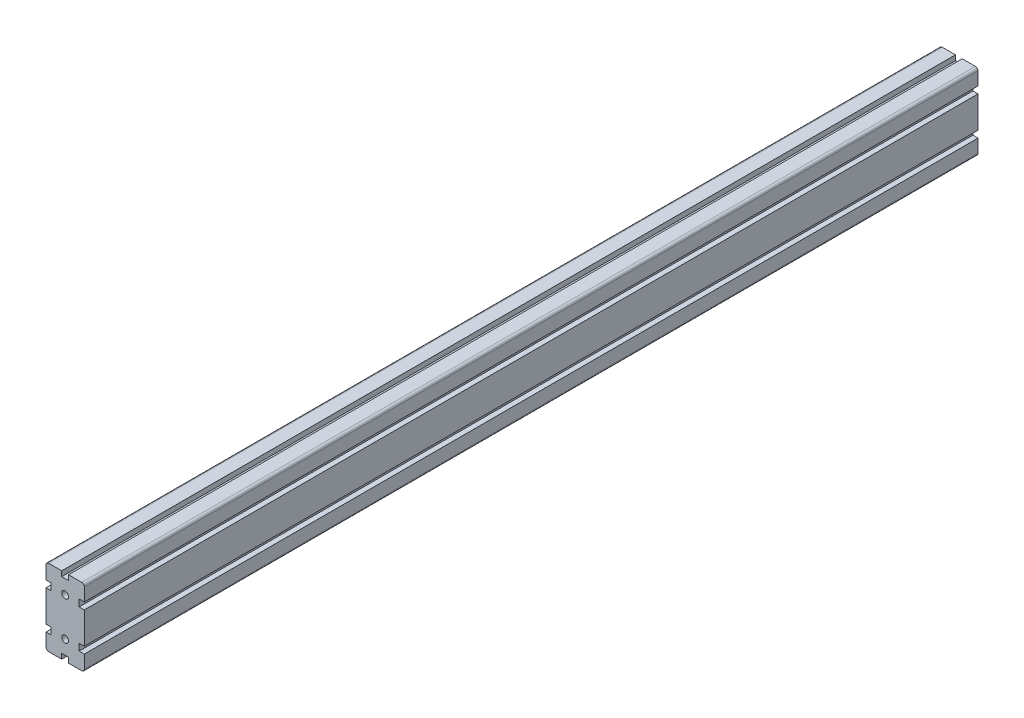
ISO-10303-21;
HEADER;
FILE_DESCRIPTION(('STEP AP214'),'2;1');
FILE_NAME('part.step','',(''),(''),'','','');
FILE_SCHEMA(('AUTOMOTIVE_DESIGN { 1 0 10303 214 1 1 1 1 }'));
ENDSEC;
DATA;
#1=APPLICATION_CONTEXT('core data for automotive mechanical design processes');
#2=APPLICATION_PROTOCOL_DEFINITION('international standard','automotive_design',2000,#1);
#3=PRODUCT_CONTEXT('',#1,'mechanical');
#4=PRODUCT('Part','Part','',(#3));
#5=PRODUCT_RELATED_PRODUCT_CATEGORY('part','',(#4));
#6=PRODUCT_DEFINITION_FORMATION('','',#4);
#7=PRODUCT_DEFINITION_CONTEXT('part definition',#1,'design');
#8=PRODUCT_DEFINITION('design','',#6,#7);
#9=PRODUCT_DEFINITION_SHAPE('','',#8);
#10=(LENGTH_UNIT() NAMED_UNIT(*) SI_UNIT(.MILLI.,.METRE.));
#11=(NAMED_UNIT(*) PLANE_ANGLE_UNIT() SI_UNIT($,.RADIAN.));
#12=(NAMED_UNIT(*) SI_UNIT($,.STERADIAN.) SOLID_ANGLE_UNIT());
#13=UNCERTAINTY_MEASURE_WITH_UNIT(LENGTH_MEASURE(1.E-05),#10,'distance_accuracy_value','');
#14=(GEOMETRIC_REPRESENTATION_CONTEXT(3) GLOBAL_UNCERTAINTY_ASSIGNED_CONTEXT((#13)) GLOBAL_UNIT_ASSIGNED_CONTEXT((#10,
#11,#12)) REPRESENTATION_CONTEXT('',''));
#15=CARTESIAN_POINT('',(0.,0.,0.));
#16=DIRECTION('',(0.,0.,1.));
#17=DIRECTION('',(1.,0.,0.));
#18=AXIS2_PLACEMENT_3D('',#15,#16,#17);
#19=CARTESIAN_POINT('',(-16.5000000000007,26.5000000000001,50.));
#20=DIRECTION('',(-1.,0.,0.));
#21=DIRECTION('',(0.,0.,1.));
#22=AXIS2_PLACEMENT_3D('',#19,#20,#21);
#23=PLANE('',#22);
#24=DIRECTION('',(0.,1.,0.));
#25=VECTOR('',#24,1.);
#26=CARTESIAN_POINT('',(-16.5000000000007,26.5000000000001,-1000.));
#27=LINE('',#26,#25);
#28=CARTESIAN_POINT('',(-16.5000000000007,18.4999999999999,-1000.));
#29=VERTEX_POINT('',#28);
#30=CARTESIAN_POINT('',(-16.5000000000007,26.5000000000001,-1000.));
#31=VERTEX_POINT('',#30);
#32=EDGE_CURVE('E273',#29,#31,#27,.T.);
#33=ORIENTED_EDGE('',*,*,#32,.F.);
#34=DIRECTION('',(0.,0.,-1.));
#35=VECTOR('',#34,1.);
#36=CARTESIAN_POINT('',(-16.5000000000007,18.4999999999999,50.));
#37=LINE('',#36,#35);
#38=CARTESIAN_POINT('',(-16.5000000000007,18.4999999999999,50.));
#39=VERTEX_POINT('',#38);
#40=EDGE_CURVE('E11',#39,#29,#37,.T.);
#41=ORIENTED_EDGE('',*,*,#40,.F.);
#42=DIRECTION('',(0.,1.,0.));
#43=VECTOR('',#42,1.);
#44=CARTESIAN_POINT('',(-16.5000000000007,26.5000000000001,50.));
#45=LINE('',#44,#43);
#46=CARTESIAN_POINT('',(-16.5000000000007,26.5000000000001,50.));
#47=VERTEX_POINT('',#46);
#48=EDGE_CURVE('E366',#39,#47,#45,.T.);
#49=ORIENTED_EDGE('',*,*,#48,.T.);
#50=DIRECTION('',(0.,0.,-1.));
#51=VECTOR('',#50,1.);
#52=CARTESIAN_POINT('',(-16.5000000000007,26.5000000000001,50.));
#53=LINE('',#52,#51);
#54=EDGE_CURVE('E35',#47,#31,#53,.T.);
#55=ORIENTED_EDGE('',*,*,#54,.T.);
#56=EDGE_LOOP('',(#33,#41,#49,#55));
#57=FACE_BOUND('',#56,.T.);
#58=ADVANCED_FACE('F32',(#57),#23,.T.);
#59=CARTESIAN_POINT('',(-22.5,18.4999999999999,50.));
#60=DIRECTION('',(0.,1.,0.));
#61=DIRECTION('',(0.,0.,1.));
#62=AXIS2_PLACEMENT_3D('',#59,#60,#61);
#63=PLANE('',#62);
#64=DIRECTION('',(1.,0.,0.));
#65=VECTOR('',#64,1.);
#66=CARTESIAN_POINT('',(-22.5,18.4999999999999,-1000.));
#67=LINE('',#66,#65);
#68=CARTESIAN_POINT('',(-22.5,18.4999999999999,-1000.));
#69=VERTEX_POINT('',#68);
#70=EDGE_CURVE('E364',#69,#29,#67,.T.);
#71=ORIENTED_EDGE('',*,*,#70,.F.);
#72=DIRECTION('',(0.,0.,-1.));
#73=VECTOR('',#72,1.);
#74=CARTESIAN_POINT('',(-22.5,18.4999999999999,50.));
#75=LINE('',#74,#73);
#76=CARTESIAN_POINT('',(-22.5,18.4999999999999,50.));
#77=VERTEX_POINT('',#76);
#78=EDGE_CURVE('E41',#77,#69,#75,.T.);
#79=ORIENTED_EDGE('',*,*,#78,.F.);
#80=DIRECTION('',(1.,0.,0.));
#81=VECTOR('',#80,1.);
#82=CARTESIAN_POINT('',(-22.5,18.4999999999999,50.));
#83=LINE('',#82,#81);
#84=EDGE_CURVE('E263',#77,#39,#83,.T.);
#85=ORIENTED_EDGE('',*,*,#84,.T.);
#86=ORIENTED_EDGE('',*,*,#40,.T.);
#87=EDGE_LOOP('',(#71,#79,#85,#86));
#88=FACE_BOUND('',#87,.T.);
#89=ADVANCED_FACE('F426',(#88),#63,.T.);
#90=CARTESIAN_POINT('',(-22.5,-18.5,50.));
#91=DIRECTION('',(-1.,0.,0.));
#92=DIRECTION('',(0.,-1.,0.));
#93=AXIS2_PLACEMENT_3D('',#90,#91,#92);
#94=PLANE('',#93);
#95=DIRECTION('',(0.,1.,0.));
#96=VECTOR('',#95,1.);
#97=CARTESIAN_POINT('',(-22.5,-18.5,-1000.));
#98=LINE('',#97,#96);
#99=CARTESIAN_POINT('',(-22.5,-18.5,-1000.));
#100=VERTEX_POINT('',#99);
#101=EDGE_CURVE('E250',#100,#69,#98,.T.);
#102=ORIENTED_EDGE('',*,*,#101,.F.);
#103=DIRECTION('',(0.,0.,-1.));
#104=VECTOR('',#103,1.);
#105=CARTESIAN_POINT('',(-22.5,-18.5,50.));
#106=LINE('',#105,#104);
#107=CARTESIAN_POINT('',(-22.5,-18.5,50.));
#108=VERTEX_POINT('',#107);
#109=EDGE_CURVE('E245',#108,#100,#106,.T.);
#110=ORIENTED_EDGE('',*,*,#109,.F.);
#111=DIRECTION('',(0.,1.,0.));
#112=VECTOR('',#111,1.);
#113=CARTESIAN_POINT('',(-22.5,-18.5,50.));
#114=LINE('',#113,#112);
#115=EDGE_CURVE('E248',#108,#77,#114,.T.);
#116=ORIENTED_EDGE('',*,*,#115,.T.);
#117=ORIENTED_EDGE('',*,*,#78,.T.);
#118=EDGE_LOOP('',(#102,#110,#116,#117));
#119=FACE_BOUND('',#118,.T.);
#120=ADVANCED_FACE('F247',(#119),#94,.T.);
#121=CARTESIAN_POINT('',(-16.5000000000017,-18.5,50.));
#122=DIRECTION('',(0.,-1.,0.));
#123=DIRECTION('',(0.,0.,-1.));
#124=AXIS2_PLACEMENT_3D('',#121,#122,#123);
#125=PLANE('',#124);
#126=DIRECTION('',(-1.,0.,0.));
#127=VECTOR('',#126,1.);
#128=CARTESIAN_POINT('',(-16.5000000000017,-18.5,-1000.));
#129=LINE('',#128,#127);
#130=CARTESIAN_POINT('',(-16.5000000000017,-18.5,-1000.));
#131=VERTEX_POINT('',#130);
#132=EDGE_CURVE('E361',#131,#100,#129,.T.);
#133=ORIENTED_EDGE('',*,*,#132,.F.);
#134=DIRECTION('',(0.,0.,-1.));
#135=VECTOR('',#134,1.);
#136=CARTESIAN_POINT('',(-16.5000000000017,-18.5,50.));
#137=LINE('',#136,#135);
#138=CARTESIAN_POINT('',(-16.5000000000017,-18.5,50.));
#139=VERTEX_POINT('',#138);
#140=EDGE_CURVE('E255',#139,#131,#137,.T.);
#141=ORIENTED_EDGE('',*,*,#140,.F.);
#142=DIRECTION('',(-1.,0.,0.));
#143=VECTOR('',#142,1.);
#144=CARTESIAN_POINT('',(-16.5000000000017,-18.5,50.));
#145=LINE('',#144,#143);
#146=EDGE_CURVE('E261',#139,#108,#145,.T.);
#147=ORIENTED_EDGE('',*,*,#146,.T.);
#148=ORIENTED_EDGE('',*,*,#109,.T.);
#149=EDGE_LOOP('',(#133,#141,#147,#148));
#150=FACE_BOUND('',#149,.T.);
#151=ADVANCED_FACE('F265',(#150),#125,.T.);
#152=CARTESIAN_POINT('',(-16.5000000000017,-18.5,50.));
#153=DIRECTION('',(-1.,0.,0.));
#154=DIRECTION('',(0.,0.,1.));
#155=AXIS2_PLACEMENT_3D('',#152,#153,#154);
#156=PLANE('',#155);
#157=DIRECTION('',(0.,1.,0.));
#158=VECTOR('',#157,1.);
#159=CARTESIAN_POINT('',(-16.5000000000017,-18.5,-1000.));
#160=LINE('',#159,#158);
#161=CARTESIAN_POINT('',(-16.5000000000017,-26.5,-1000.));
#162=VERTEX_POINT('',#161);
#163=EDGE_CURVE('E358',#162,#131,#160,.T.);
#164=ORIENTED_EDGE('',*,*,#163,.F.);
#165=DIRECTION('',(0.,0.,-1.));
#166=VECTOR('',#165,1.);
#167=CARTESIAN_POINT('',(-16.5000000000017,-26.5,50.));
#168=LINE('',#167,#166);
#169=CARTESIAN_POINT('',(-16.5000000000017,-26.5,50.));
#170=VERTEX_POINT('',#169);
#171=EDGE_CURVE('E370',#170,#162,#168,.T.);
#172=ORIENTED_EDGE('',*,*,#171,.F.);
#173=DIRECTION('',(0.,1.,0.));
#174=VECTOR('',#173,1.);
#175=CARTESIAN_POINT('',(-16.5000000000017,-18.5,50.));
#176=LINE('',#175,#174);
#177=EDGE_CURVE('E266',#170,#139,#176,.T.);
#178=ORIENTED_EDGE('',*,*,#177,.T.);
#179=ORIENTED_EDGE('',*,*,#140,.T.);
#180=EDGE_LOOP('',(#164,#172,#178,#179));
#181=FACE_BOUND('',#180,.T.);
#182=ADVANCED_FACE('F439',(#181),#156,.T.);
#183=CARTESIAN_POINT('',(-22.5,-26.5,50.));
#184=DIRECTION('',(0.,1.,0.));
#185=DIRECTION('',(0.,0.,1.));
#186=AXIS2_PLACEMENT_3D('',#183,#184,#185);
#187=PLANE('',#186);
#188=DIRECTION('',(1.,0.,0.));
#189=VECTOR('',#188,1.);
#190=CARTESIAN_POINT('',(-22.5,-26.5,-1000.));
#191=LINE('',#190,#189);
#192=CARTESIAN_POINT('',(-22.5,-26.5,-1000.));
#193=VERTEX_POINT('',#192);
#194=EDGE_CURVE('E355',#193,#162,#191,.T.);
#195=ORIENTED_EDGE('',*,*,#194,.F.);
#196=DIRECTION('',(0.,0.,-1.));
#197=VECTOR('',#196,1.);
#198=CARTESIAN_POINT('',(-22.5,-26.5,50.));
#199=LINE('',#198,#197);
#200=CARTESIAN_POINT('',(-22.5,-26.5,50.));
#201=VERTEX_POINT('',#200);
#202=EDGE_CURVE('E372',#201,#193,#199,.T.);
#203=ORIENTED_EDGE('',*,*,#202,.F.);
#204=DIRECTION('',(1.,0.,0.));
#205=VECTOR('',#204,1.);
#206=CARTESIAN_POINT('',(-22.5,-26.5,50.));
#207=LINE('',#206,#205);
#208=EDGE_CURVE('E268',#201,#170,#207,.T.);
#209=ORIENTED_EDGE('',*,*,#208,.T.);
#210=ORIENTED_EDGE('',*,*,#171,.T.);
#211=EDGE_LOOP('',(#195,#203,#209,#210));
#212=FACE_BOUND('',#211,.T.);
#213=ADVANCED_FACE('F442',(#212),#187,.T.);
#214=CARTESIAN_POINT('',(-22.5,-42.,50.));
#215=DIRECTION('',(-1.,0.,0.));
#216=DIRECTION('',(0.,0.,1.));
#217=AXIS2_PLACEMENT_3D('',#214,#215,#216);
#218=PLANE('',#217);
#219=DIRECTION('',(0.,1.,0.));
#220=VECTOR('',#219,1.);
#221=CARTESIAN_POINT('',(-22.5,-42.,-1000.));
#222=LINE('',#221,#220);
#223=CARTESIAN_POINT('',(-22.5,-42.,-1000.));
#224=VERTEX_POINT('',#223);
#225=EDGE_CURVE('E352',#224,#193,#222,.T.);
#226=ORIENTED_EDGE('',*,*,#225,.F.);
#227=DIRECTION('',(0.,0.,-1.));
#228=VECTOR('',#227,1.);
#229=CARTESIAN_POINT('',(-22.5,-42.,50.));
#230=LINE('',#229,#228);
#231=CARTESIAN_POINT('',(-22.5,-42.,50.));
#232=VERTEX_POINT('',#231);
#233=EDGE_CURVE('E374',#232,#224,#230,.T.);
#234=ORIENTED_EDGE('',*,*,#233,.F.);
#235=DIRECTION('',(0.,1.,0.));
#236=VECTOR('',#235,1.);
#237=CARTESIAN_POINT('',(-22.5,-42.,50.));
#238=LINE('',#237,#236);
#239=EDGE_CURVE('E656',#232,#201,#238,.T.);
#240=ORIENTED_EDGE('',*,*,#239,.T.);
#241=ORIENTED_EDGE('',*,*,#202,.T.);
#242=EDGE_LOOP('',(#226,#234,#240,#241));
#243=FACE_BOUND('',#242,.T.);
#244=ADVANCED_FACE('F446',(#243),#218,.T.);
#245=CARTESIAN_POINT('',(-19.5000000000004,-42.,50.));
#246=DIRECTION('',(0.,0.,-1.));
#247=DIRECTION('',(-1.,0.,0.));
#248=AXIS2_PLACEMENT_3D('',#245,#246,#247);
#249=CYLINDRICAL_SURFACE('',#248,2.99999999999956);
#250=CARTESIAN_POINT('',(-19.5000000000004,-42.,-1000.));
#251=DIRECTION('',(0.,0.,-1.));
#252=DIRECTION('',(-1.,0.,0.));
#253=AXIS2_PLACEMENT_3D('',#250,#251,#252);
#254=CIRCLE('',#253,2.99999999999956);
#255=CARTESIAN_POINT('',(-19.5000000000004,-44.9999999999996,-1000.));
#256=VERTEX_POINT('',#255);
#257=EDGE_CURVE('E349',#256,#224,#254,.T.);
#258=ORIENTED_EDGE('',*,*,#257,.F.);
#259=DIRECTION('',(0.,0.,-1.));
#260=VECTOR('',#259,1.);
#261=CARTESIAN_POINT('',(-19.5000000000004,-44.9999999999996,50.));
#262=LINE('',#261,#260);
#263=CARTESIAN_POINT('',(-19.5000000000004,-44.9999999999996,50.));
#264=VERTEX_POINT('',#263);
#265=EDGE_CURVE('E376',#264,#256,#262,.T.);
#266=ORIENTED_EDGE('',*,*,#265,.F.);
#267=CARTESIAN_POINT('',(-19.5000000000004,-42.,50.));
#268=DIRECTION('',(0.,0.,-1.));
#269=DIRECTION('',(-1.,0.,0.));
#270=AXIS2_PLACEMENT_3D('',#267,#268,#269);
#271=CIRCLE('',#270,2.99999999999956);
#272=EDGE_CURVE('E653',#264,#232,#271,.T.);
#273=ORIENTED_EDGE('',*,*,#272,.T.);
#274=ORIENTED_EDGE('',*,*,#233,.T.);
#275=EDGE_LOOP('',(#258,#266,#273,#274));
#276=FACE_BOUND('',#275,.T.);
#277=ADVANCED_FACE('F450',(#276),#249,.T.);
#278=CARTESIAN_POINT('',(-4.00000000000001,-44.9999999999996,50.));
#279=DIRECTION('',(0.,-1.,0.));
#280=DIRECTION('',(0.,0.,-1.));
#281=AXIS2_PLACEMENT_3D('',#278,#279,#280);
#282=PLANE('',#281);
#283=DIRECTION('',(-1.,0.,0.));
#284=VECTOR('',#283,1.);
#285=CARTESIAN_POINT('',(-4.00000000000001,-44.9999999999996,-1000.));
#286=LINE('',#285,#284);
#287=CARTESIAN_POINT('',(-4.00000000000001,-44.9999999999996,-1000.));
#288=VERTEX_POINT('',#287);
#289=EDGE_CURVE('E346',#288,#256,#286,.T.);
#290=ORIENTED_EDGE('',*,*,#289,.F.);
#291=DIRECTION('',(0.,0.,-1.));
#292=VECTOR('',#291,1.);
#293=CARTESIAN_POINT('',(-4.00000000000001,-44.9999999999996,50.));
#294=LINE('',#293,#292);
#295=CARTESIAN_POINT('',(-4.00000000000001,-44.9999999999996,50.));
#296=VERTEX_POINT('',#295);
#297=EDGE_CURVE('E378',#296,#288,#294,.T.);
#298=ORIENTED_EDGE('',*,*,#297,.F.);
#299=DIRECTION('',(-1.,0.,0.));
#300=VECTOR('',#299,1.);
#301=CARTESIAN_POINT('',(-4.00000000000001,-44.9999999999996,50.));
#302=LINE('',#301,#300);
#303=EDGE_CURVE('E650',#296,#264,#302,.T.);
#304=ORIENTED_EDGE('',*,*,#303,.T.);
#305=ORIENTED_EDGE('',*,*,#265,.T.);
#306=EDGE_LOOP('',(#290,#298,#304,#305));
#307=FACE_BOUND('',#306,.T.);
#308=ADVANCED_FACE('F454',(#307),#282,.T.);
#309=CARTESIAN_POINT('',(-4.00000000000001,-39.,50.));
#310=DIRECTION('',(1.,0.,0.));
#311=DIRECTION('',(0.,1.,0.));
#312=AXIS2_PLACEMENT_3D('',#309,#310,#311);
#313=PLANE('',#312);
#314=DIRECTION('',(0.,-1.,0.));
#315=VECTOR('',#314,1.);
#316=CARTESIAN_POINT('',(-4.00000000000001,-39.,-1000.));
#317=LINE('',#316,#315);
#318=CARTESIAN_POINT('',(-4.00000000000001,-39.,-1000.));
#319=VERTEX_POINT('',#318);
#320=EDGE_CURVE('E343',#319,#288,#317,.T.);
#321=ORIENTED_EDGE('',*,*,#320,.F.);
#322=DIRECTION('',(0.,0.,-1.));
#323=VECTOR('',#322,1.);
#324=CARTESIAN_POINT('',(-4.00000000000001,-39.,50.));
#325=LINE('',#324,#323);
#326=CARTESIAN_POINT('',(-4.00000000000001,-39.,50.));
#327=VERTEX_POINT('',#326);
#328=EDGE_CURVE('E380',#327,#319,#325,.T.);
#329=ORIENTED_EDGE('',*,*,#328,.F.);
#330=DIRECTION('',(0.,-1.,0.));
#331=VECTOR('',#330,1.);
#332=CARTESIAN_POINT('',(-4.00000000000001,-39.,50.));
#333=LINE('',#332,#331);
#334=EDGE_CURVE('E647',#327,#296,#333,.T.);
#335=ORIENTED_EDGE('',*,*,#334,.T.);
#336=ORIENTED_EDGE('',*,*,#297,.T.);
#337=EDGE_LOOP('',(#321,#329,#335,#336));
#338=FACE_BOUND('',#337,.T.);
#339=ADVANCED_FACE('F458',(#338),#313,.T.);
#340=CARTESIAN_POINT('',(3.99999999999999,-39.,50.));
#341=DIRECTION('',(0.,-1.,0.));
#342=DIRECTION('',(0.,0.,-1.));
#343=AXIS2_PLACEMENT_3D('',#340,#341,#342);
#344=PLANE('',#343);
#345=DIRECTION('',(-1.,0.,0.));
#346=VECTOR('',#345,1.);
#347=CARTESIAN_POINT('',(3.99999999999999,-39.,-1000.));
#348=LINE('',#347,#346);
#349=CARTESIAN_POINT('',(3.99999999999999,-39.,-1000.));
#350=VERTEX_POINT('',#349);
#351=EDGE_CURVE('E340',#350,#319,#348,.T.);
#352=ORIENTED_EDGE('',*,*,#351,.F.);
#353=DIRECTION('',(0.,0.,-1.));
#354=VECTOR('',#353,1.);
#355=CARTESIAN_POINT('',(3.99999999999999,-39.,50.));
#356=LINE('',#355,#354);
#357=CARTESIAN_POINT('',(3.99999999999999,-39.,50.));
#358=VERTEX_POINT('',#357);
#359=EDGE_CURVE('E382',#358,#350,#356,.T.);
#360=ORIENTED_EDGE('',*,*,#359,.F.);
#361=DIRECTION('',(-1.,0.,0.));
#362=VECTOR('',#361,1.);
#363=CARTESIAN_POINT('',(3.99999999999999,-39.,50.));
#364=LINE('',#363,#362);
#365=EDGE_CURVE('E644',#358,#327,#364,.T.);
#366=ORIENTED_EDGE('',*,*,#365,.T.);
#367=ORIENTED_EDGE('',*,*,#328,.T.);
#368=EDGE_LOOP('',(#352,#360,#366,#367));
#369=FACE_BOUND('',#368,.T.);
#370=ADVANCED_FACE('F462',(#369),#344,.T.);
#371=CARTESIAN_POINT('',(3.99999999999999,-44.9999999999996,50.));
#372=DIRECTION('',(-1.,0.,0.));
#373=DIRECTION('',(0.,-1.,0.));
#374=AXIS2_PLACEMENT_3D('',#371,#372,#373);
#375=PLANE('',#374);
#376=DIRECTION('',(0.,1.,0.));
#377=VECTOR('',#376,1.);
#378=CARTESIAN_POINT('',(3.99999999999999,-44.9999999999996,-1000.));
#379=LINE('',#378,#377);
#380=CARTESIAN_POINT('',(3.99999999999999,-44.9999999999996,-1000.));
#381=VERTEX_POINT('',#380);
#382=EDGE_CURVE('E337',#381,#350,#379,.T.);
#383=ORIENTED_EDGE('',*,*,#382,.F.);
#384=DIRECTION('',(0.,0.,-1.));
#385=VECTOR('',#384,1.);
#386=CARTESIAN_POINT('',(3.99999999999999,-44.9999999999996,50.));
#387=LINE('',#386,#385);
#388=CARTESIAN_POINT('',(3.99999999999999,-44.9999999999996,50.));
#389=VERTEX_POINT('',#388);
#390=EDGE_CURVE('E384',#389,#381,#387,.T.);
#391=ORIENTED_EDGE('',*,*,#390,.F.);
#392=DIRECTION('',(0.,1.,0.));
#393=VECTOR('',#392,1.);
#394=CARTESIAN_POINT('',(3.99999999999999,-44.9999999999996,50.));
#395=LINE('',#394,#393);
#396=EDGE_CURVE('E641',#389,#358,#395,.T.);
#397=ORIENTED_EDGE('',*,*,#396,.T.);
#398=ORIENTED_EDGE('',*,*,#359,.T.);
#399=EDGE_LOOP('',(#383,#391,#397,#398));
#400=FACE_BOUND('',#399,.T.);
#401=ADVANCED_FACE('F466',(#400),#375,.T.);
#402=CARTESIAN_POINT('',(19.4999999999996,-44.9999999999996,50.));
#403=DIRECTION('',(0.,-1.,0.));
#404=DIRECTION('',(0.,0.,-1.));
#405=AXIS2_PLACEMENT_3D('',#402,#403,#404);
#406=PLANE('',#405);
#407=DIRECTION('',(-1.,0.,0.));
#408=VECTOR('',#407,1.);
#409=CARTESIAN_POINT('',(19.4999999999996,-44.9999999999996,-1000.));
#410=LINE('',#409,#408);
#411=CARTESIAN_POINT('',(19.4999999999996,-44.9999999999996,-1000.));
#412=VERTEX_POINT('',#411);
#413=EDGE_CURVE('E334',#412,#381,#410,.T.);
#414=ORIENTED_EDGE('',*,*,#413,.F.);
#415=DIRECTION('',(0.,0.,-1.));
#416=VECTOR('',#415,1.);
#417=CARTESIAN_POINT('',(19.4999999999996,-44.9999999999996,50.));
#418=LINE('',#417,#416);
#419=CARTESIAN_POINT('',(19.4999999999996,-44.9999999999996,50.));
#420=VERTEX_POINT('',#419);
#421=EDGE_CURVE('E386',#420,#412,#418,.T.);
#422=ORIENTED_EDGE('',*,*,#421,.F.);
#423=DIRECTION('',(-1.,0.,0.));
#424=VECTOR('',#423,1.);
#425=CARTESIAN_POINT('',(19.4999999999996,-44.9999999999996,50.));
#426=LINE('',#425,#424);
#427=EDGE_CURVE('E638',#420,#389,#426,.T.);
#428=ORIENTED_EDGE('',*,*,#427,.T.);
#429=ORIENTED_EDGE('',*,*,#390,.T.);
#430=EDGE_LOOP('',(#414,#422,#428,#429));
#431=FACE_BOUND('',#430,.T.);
#432=ADVANCED_FACE('F470',(#431),#406,.T.);
#433=CARTESIAN_POINT('',(19.4999999999996,-41.9999999999999,50.));
#434=DIRECTION('',(0.,0.,-1.));
#435=DIRECTION('',(-1.,0.,0.));
#436=AXIS2_PLACEMENT_3D('',#433,#434,#435);
#437=CYLINDRICAL_SURFACE('',#436,2.9999999999997);
#438=CARTESIAN_POINT('',(19.4999999999996,-41.9999999999999,-1000.));
#439=DIRECTION('',(0.,0.,-1.));
#440=DIRECTION('',(-1.,0.,0.));
#441=AXIS2_PLACEMENT_3D('',#438,#439,#440);
#442=CIRCLE('',#441,2.9999999999997);
#443=CARTESIAN_POINT('',(22.4999999999993,-41.9999999999999,-1000.));
#444=VERTEX_POINT('',#443);
#445=EDGE_CURVE('E331',#444,#412,#442,.T.);
#446=ORIENTED_EDGE('',*,*,#445,.F.);
#447=DIRECTION('',(0.,0.,-1.));
#448=VECTOR('',#447,1.);
#449=CARTESIAN_POINT('',(22.4999999999993,-41.9999999999999,50.));
#450=LINE('',#449,#448);
#451=CARTESIAN_POINT('',(22.4999999999993,-41.9999999999999,50.));
#452=VERTEX_POINT('',#451);
#453=EDGE_CURVE('E388',#452,#444,#450,.T.);
#454=ORIENTED_EDGE('',*,*,#453,.F.);
#455=CARTESIAN_POINT('',(19.4999999999996,-41.9999999999999,50.));
#456=DIRECTION('',(0.,0.,-1.));
#457=DIRECTION('',(-1.,0.,0.));
#458=AXIS2_PLACEMENT_3D('',#455,#456,#457);
#459=CIRCLE('',#458,2.9999999999997);
#460=EDGE_CURVE('E635',#452,#420,#459,.T.);
#461=ORIENTED_EDGE('',*,*,#460,.T.);
#462=ORIENTED_EDGE('',*,*,#421,.T.);
#463=EDGE_LOOP('',(#446,#454,#461,#462));
#464=FACE_BOUND('',#463,.T.);
#465=ADVANCED_FACE('F474',(#464),#437,.T.);
#466=CARTESIAN_POINT('',(22.4999999999993,-26.5,50.));
#467=DIRECTION('',(1.,0.,0.));
#468=DIRECTION('',(0.,1.,0.));
#469=AXIS2_PLACEMENT_3D('',#466,#467,#468);
#470=PLANE('',#469);
#471=DIRECTION('',(0.,-1.,0.));
#472=VECTOR('',#471,1.);
#473=CARTESIAN_POINT('',(22.4999999999993,-26.5,-1000.));
#474=LINE('',#473,#472);
#475=CARTESIAN_POINT('',(22.4999999999993,-26.5,-1000.));
#476=VERTEX_POINT('',#475);
#477=EDGE_CURVE('E328',#476,#444,#474,.T.);
#478=ORIENTED_EDGE('',*,*,#477,.F.);
#479=DIRECTION('',(0.,0.,-1.));
#480=VECTOR('',#479,1.);
#481=CARTESIAN_POINT('',(22.4999999999993,-26.5,50.));
#482=LINE('',#481,#480);
#483=CARTESIAN_POINT('',(22.4999999999993,-26.5,50.));
#484=VERTEX_POINT('',#483);
#485=EDGE_CURVE('E390',#484,#476,#482,.T.);
#486=ORIENTED_EDGE('',*,*,#485,.F.);
#487=DIRECTION('',(0.,-1.,0.));
#488=VECTOR('',#487,1.);
#489=CARTESIAN_POINT('',(22.4999999999993,-26.5,50.));
#490=LINE('',#489,#488);
#491=EDGE_CURVE('E632',#484,#452,#490,.T.);
#492=ORIENTED_EDGE('',*,*,#491,.T.);
#493=ORIENTED_EDGE('',*,*,#453,.T.);
#494=EDGE_LOOP('',(#478,#486,#492,#493));
#495=FACE_BOUND('',#494,.T.);
#496=ADVANCED_FACE('F478',(#495),#470,.T.);
#497=CARTESIAN_POINT('',(16.4999999999983,-26.5,50.));
#498=DIRECTION('',(0.,1.,0.));
#499=DIRECTION('',(0.,0.,1.));
#500=AXIS2_PLACEMENT_3D('',#497,#498,#499);
#501=PLANE('',#500);
#502=DIRECTION('',(1.,0.,0.));
#503=VECTOR('',#502,1.);
#504=CARTESIAN_POINT('',(16.4999999999983,-26.5,-1000.));
#505=LINE('',#504,#503);
#506=CARTESIAN_POINT('',(16.4999999999983,-26.5,-1000.));
#507=VERTEX_POINT('',#506);
#508=EDGE_CURVE('E325',#507,#476,#505,.T.);
#509=ORIENTED_EDGE('',*,*,#508,.F.);
#510=DIRECTION('',(0.,0.,-1.));
#511=VECTOR('',#510,1.);
#512=CARTESIAN_POINT('',(16.4999999999983,-26.5,50.));
#513=LINE('',#512,#511);
#514=CARTESIAN_POINT('',(16.4999999999983,-26.5,50.));
#515=VERTEX_POINT('',#514);
#516=EDGE_CURVE('E392',#515,#507,#513,.T.);
#517=ORIENTED_EDGE('',*,*,#516,.F.);
#518=DIRECTION('',(1.,0.,0.));
#519=VECTOR('',#518,1.);
#520=CARTESIAN_POINT('',(16.4999999999983,-26.5,50.));
#521=LINE('',#520,#519);
#522=EDGE_CURVE('E629',#515,#484,#521,.T.);
#523=ORIENTED_EDGE('',*,*,#522,.T.);
#524=ORIENTED_EDGE('',*,*,#485,.T.);
#525=EDGE_LOOP('',(#509,#517,#523,#524));
#526=FACE_BOUND('',#525,.T.);
#527=ADVANCED_FACE('F482',(#526),#501,.T.);
#528=CARTESIAN_POINT('',(16.4999999999983,-18.5,50.));
#529=DIRECTION('',(1.,0.,0.));
#530=DIRECTION('',(0.,0.,-1.));
#531=AXIS2_PLACEMENT_3D('',#528,#529,#530);
#532=PLANE('',#531);
#533=DIRECTION('',(0.,-1.,0.));
#534=VECTOR('',#533,1.);
#535=CARTESIAN_POINT('',(16.4999999999983,-18.5,-1000.));
#536=LINE('',#535,#534);
#537=CARTESIAN_POINT('',(16.4999999999983,-18.5,-1000.));
#538=VERTEX_POINT('',#537);
#539=EDGE_CURVE('E322',#538,#507,#536,.T.);
#540=ORIENTED_EDGE('',*,*,#539,.F.);
#541=DIRECTION('',(0.,0.,-1.));
#542=VECTOR('',#541,1.);
#543=CARTESIAN_POINT('',(16.4999999999983,-18.5,50.));
#544=LINE('',#543,#542);
#545=CARTESIAN_POINT('',(16.4999999999983,-18.5,50.));
#546=VERTEX_POINT('',#545);
#547=EDGE_CURVE('E394',#546,#538,#544,.T.);
#548=ORIENTED_EDGE('',*,*,#547,.F.);
#549=DIRECTION('',(0.,-1.,0.));
#550=VECTOR('',#549,1.);
#551=CARTESIAN_POINT('',(16.4999999999983,-18.5,50.));
#552=LINE('',#551,#550);
#553=EDGE_CURVE('E626',#546,#515,#552,.T.);
#554=ORIENTED_EDGE('',*,*,#553,.T.);
#555=ORIENTED_EDGE('',*,*,#516,.T.);
#556=EDGE_LOOP('',(#540,#548,#554,#555));
#557=FACE_BOUND('',#556,.T.);
#558=ADVANCED_FACE('F486',(#557),#532,.T.);
#559=CARTESIAN_POINT('',(22.4999999999993,-18.5,50.));
#560=DIRECTION('',(0.,-1.,0.));
#561=DIRECTION('',(0.,0.,-1.));
#562=AXIS2_PLACEMENT_3D('',#559,#560,#561);
#563=PLANE('',#562);
#564=DIRECTION('',(-1.,0.,0.));
#565=VECTOR('',#564,1.);
#566=CARTESIAN_POINT('',(22.4999999999993,-18.5,-1000.));
#567=LINE('',#566,#565);
#568=CARTESIAN_POINT('',(22.4999999999993,-18.5,-1000.));
#569=VERTEX_POINT('',#568);
#570=EDGE_CURVE('E319',#569,#538,#567,.T.);
#571=ORIENTED_EDGE('',*,*,#570,.F.);
#572=DIRECTION('',(0.,0.,-1.));
#573=VECTOR('',#572,1.);
#574=CARTESIAN_POINT('',(22.4999999999993,-18.5,50.));
#575=LINE('',#574,#573);
#576=CARTESIAN_POINT('',(22.4999999999993,-18.5,50.));
#577=VERTEX_POINT('',#576);
#578=EDGE_CURVE('E396',#577,#569,#575,.T.);
#579=ORIENTED_EDGE('',*,*,#578,.F.);
#580=DIRECTION('',(-1.,0.,0.));
#581=VECTOR('',#580,1.);
#582=CARTESIAN_POINT('',(22.4999999999993,-18.5,50.));
#583=LINE('',#582,#581);
#584=EDGE_CURVE('E623',#577,#546,#583,.T.);
#585=ORIENTED_EDGE('',*,*,#584,.T.);
#586=ORIENTED_EDGE('',*,*,#547,.T.);
#587=EDGE_LOOP('',(#571,#579,#585,#586));
#588=FACE_BOUND('',#587,.T.);
#589=ADVANCED_FACE('F490',(#588),#563,.T.);
#590=CARTESIAN_POINT('',(22.4999999999993,18.4999999999999,50.));
#591=DIRECTION('',(1.,0.,0.));
#592=DIRECTION('',(0.,1.,0.));
#593=AXIS2_PLACEMENT_3D('',#590,#591,#592);
#594=PLANE('',#593);
#595=DIRECTION('',(0.,-1.,0.));
#596=VECTOR('',#595,1.);
#597=CARTESIAN_POINT('',(22.4999999999993,18.4999999999999,-1000.));
#598=LINE('',#597,#596);
#599=CARTESIAN_POINT('',(22.4999999999993,18.4999999999999,-1000.));
#600=VERTEX_POINT('',#599);
#601=EDGE_CURVE('E316',#600,#569,#598,.T.);
#602=ORIENTED_EDGE('',*,*,#601,.F.);
#603=DIRECTION('',(0.,0.,-1.));
#604=VECTOR('',#603,1.);
#605=CARTESIAN_POINT('',(22.4999999999993,18.4999999999999,50.));
#606=LINE('',#605,#604);
#607=CARTESIAN_POINT('',(22.4999999999993,18.4999999999999,50.));
#608=VERTEX_POINT('',#607);
#609=EDGE_CURVE('E398',#608,#600,#606,.T.);
#610=ORIENTED_EDGE('',*,*,#609,.F.);
#611=DIRECTION('',(0.,-1.,0.));
#612=VECTOR('',#611,1.);
#613=CARTESIAN_POINT('',(22.4999999999993,18.4999999999999,50.));
#614=LINE('',#613,#612);
#615=EDGE_CURVE('E620',#608,#577,#614,.T.);
#616=ORIENTED_EDGE('',*,*,#615,.T.);
#617=ORIENTED_EDGE('',*,*,#578,.T.);
#618=EDGE_LOOP('',(#602,#610,#616,#617));
#619=FACE_BOUND('',#618,.T.);
#620=ADVANCED_FACE('F494',(#619),#594,.T.);
#621=CARTESIAN_POINT('',(16.4999999999993,18.4999999999999,50.));
#622=DIRECTION('',(0.,1.,0.));
#623=DIRECTION('',(0.,0.,1.));
#624=AXIS2_PLACEMENT_3D('',#621,#622,#623);
#625=PLANE('',#624);
#626=DIRECTION('',(1.,0.,0.));
#627=VECTOR('',#626,1.);
#628=CARTESIAN_POINT('',(16.4999999999993,18.4999999999999,-1000.));
#629=LINE('',#628,#627);
#630=CARTESIAN_POINT('',(16.4999999999993,18.4999999999999,-1000.));
#631=VERTEX_POINT('',#630);
#632=EDGE_CURVE('E313',#631,#600,#629,.T.);
#633=ORIENTED_EDGE('',*,*,#632,.F.);
#634=DIRECTION('',(0.,0.,-1.));
#635=VECTOR('',#634,1.);
#636=CARTESIAN_POINT('',(16.4999999999993,18.4999999999999,50.));
#637=LINE('',#636,#635);
#638=CARTESIAN_POINT('',(16.4999999999993,18.4999999999999,50.));
#639=VERTEX_POINT('',#638);
#640=EDGE_CURVE('E400',#639,#631,#637,.T.);
#641=ORIENTED_EDGE('',*,*,#640,.F.);
#642=DIRECTION('',(1.,0.,0.));
#643=VECTOR('',#642,1.);
#644=CARTESIAN_POINT('',(16.4999999999993,18.4999999999999,50.));
#645=LINE('',#644,#643);
#646=EDGE_CURVE('E617',#639,#608,#645,.T.);
#647=ORIENTED_EDGE('',*,*,#646,.T.);
#648=ORIENTED_EDGE('',*,*,#609,.T.);
#649=EDGE_LOOP('',(#633,#641,#647,#648));
#650=FACE_BOUND('',#649,.T.);
#651=ADVANCED_FACE('F498',(#650),#625,.T.);
#652=CARTESIAN_POINT('',(16.4999999999993,26.5000000000001,50.));
#653=DIRECTION('',(1.,0.,0.));
#654=DIRECTION('',(0.,0.,-1.));
#655=AXIS2_PLACEMENT_3D('',#652,#653,#654);
#656=PLANE('',#655);
#657=DIRECTION('',(0.,-1.,0.));
#658=VECTOR('',#657,1.);
#659=CARTESIAN_POINT('',(16.4999999999993,26.5000000000001,-1000.));
#660=LINE('',#659,#658);
#661=CARTESIAN_POINT('',(16.4999999999993,26.5000000000001,-1000.));
#662=VERTEX_POINT('',#661);
#663=EDGE_CURVE('E310',#662,#631,#660,.T.);
#664=ORIENTED_EDGE('',*,*,#663,.F.);
#665=DIRECTION('',(0.,0.,-1.));
#666=VECTOR('',#665,1.);
#667=CARTESIAN_POINT('',(16.4999999999993,26.5000000000001,50.));
#668=LINE('',#667,#666);
#669=CARTESIAN_POINT('',(16.4999999999993,26.5000000000001,50.));
#670=VERTEX_POINT('',#669);
#671=EDGE_CURVE('E402',#670,#662,#668,.T.);
#672=ORIENTED_EDGE('',*,*,#671,.F.);
#673=DIRECTION('',(0.,-1.,0.));
#674=VECTOR('',#673,1.);
#675=CARTESIAN_POINT('',(16.4999999999993,26.5000000000001,50.));
#676=LINE('',#675,#674);
#677=EDGE_CURVE('E614',#670,#639,#676,.T.);
#678=ORIENTED_EDGE('',*,*,#677,.T.);
#679=ORIENTED_EDGE('',*,*,#640,.T.);
#680=EDGE_LOOP('',(#664,#672,#678,#679));
#681=FACE_BOUND('',#680,.T.);
#682=ADVANCED_FACE('F502',(#681),#656,.T.);
#683=CARTESIAN_POINT('',(22.4999999999993,26.5000000000001,50.));
#684=DIRECTION('',(0.,-1.,0.));
#685=DIRECTION('',(0.,0.,-1.));
#686=AXIS2_PLACEMENT_3D('',#683,#684,#685);
#687=PLANE('',#686);
#688=DIRECTION('',(-1.,0.,0.));
#689=VECTOR('',#688,1.);
#690=CARTESIAN_POINT('',(22.4999999999993,26.5000000000001,-1000.));
#691=LINE('',#690,#689);
#692=CARTESIAN_POINT('',(22.4999999999993,26.5000000000001,-1000.));
#693=VERTEX_POINT('',#692);
#694=EDGE_CURVE('E307',#693,#662,#691,.T.);
#695=ORIENTED_EDGE('',*,*,#694,.F.);
#696=DIRECTION('',(0.,0.,-1.));
#697=VECTOR('',#696,1.);
#698=CARTESIAN_POINT('',(22.4999999999993,26.5000000000001,50.));
#699=LINE('',#698,#697);
#700=CARTESIAN_POINT('',(22.4999999999993,26.5000000000001,50.));
#701=VERTEX_POINT('',#700);
#702=EDGE_CURVE('E404',#701,#693,#699,.T.);
#703=ORIENTED_EDGE('',*,*,#702,.F.);
#704=DIRECTION('',(-1.,0.,0.));
#705=VECTOR('',#704,1.);
#706=CARTESIAN_POINT('',(22.4999999999993,26.5000000000001,50.));
#707=LINE('',#706,#705);
#708=EDGE_CURVE('E611',#701,#670,#707,.T.);
#709=ORIENTED_EDGE('',*,*,#708,.T.);
#710=ORIENTED_EDGE('',*,*,#671,.T.);
#711=EDGE_LOOP('',(#695,#703,#709,#710));
#712=FACE_BOUND('',#711,.T.);
#713=ADVANCED_FACE('F506',(#712),#687,.T.);
#714=CARTESIAN_POINT('',(22.4999999999993,42.0000000000001,50.));
#715=DIRECTION('',(1.,0.,0.));
#716=DIRECTION('',(0.,1.,0.));
#717=AXIS2_PLACEMENT_3D('',#714,#715,#716);
#718=PLANE('',#717);
#719=DIRECTION('',(0.,-1.,0.));
#720=VECTOR('',#719,1.);
#721=CARTESIAN_POINT('',(22.4999999999993,42.0000000000001,-1000.));
#722=LINE('',#721,#720);
#723=CARTESIAN_POINT('',(22.4999999999993,42.0000000000001,-1000.));
#724=VERTEX_POINT('',#723);
#725=EDGE_CURVE('E304',#724,#693,#722,.T.);
#726=ORIENTED_EDGE('',*,*,#725,.F.);
#727=DIRECTION('',(0.,0.,-1.));
#728=VECTOR('',#727,1.);
#729=CARTESIAN_POINT('',(22.4999999999993,42.0000000000001,50.));
#730=LINE('',#729,#728);
#731=CARTESIAN_POINT('',(22.4999999999993,42.0000000000001,50.));
#732=VERTEX_POINT('',#731);
#733=EDGE_CURVE('E406',#732,#724,#730,.T.);
#734=ORIENTED_EDGE('',*,*,#733,.F.);
#735=DIRECTION('',(0.,-1.,0.));
#736=VECTOR('',#735,1.);
#737=CARTESIAN_POINT('',(22.4999999999993,42.0000000000001,50.));
#738=LINE('',#737,#736);
#739=EDGE_CURVE('E608',#732,#701,#738,.T.);
#740=ORIENTED_EDGE('',*,*,#739,.T.);
#741=ORIENTED_EDGE('',*,*,#702,.T.);
#742=EDGE_LOOP('',(#726,#734,#740,#741));
#743=FACE_BOUND('',#742,.T.);
#744=ADVANCED_FACE('F510',(#743),#718,.T.);
#745=CARTESIAN_POINT('',(19.4999999999993,42.0000000000001,50.));
#746=DIRECTION('',(0.,0.,-1.));
#747=DIRECTION('',(-1.,0.,0.));
#748=AXIS2_PLACEMENT_3D('',#745,#746,#747);
#749=CYLINDRICAL_SURFACE('',#748,3.00000000000001);
#750=CARTESIAN_POINT('',(19.4999999999993,42.0000000000001,-1000.));
#751=DIRECTION('',(0.,0.,-1.));
#752=DIRECTION('',(-1.,0.,0.));
#753=AXIS2_PLACEMENT_3D('',#750,#751,#752);
#754=CIRCLE('',#753,3.00000000000001);
#755=CARTESIAN_POINT('',(19.4999999999993,45.0000000000001,-1000.));
#756=VERTEX_POINT('',#755);
#757=EDGE_CURVE('E301',#756,#724,#754,.T.);
#758=ORIENTED_EDGE('',*,*,#757,.F.);
#759=DIRECTION('',(0.,0.,-1.));
#760=VECTOR('',#759,1.);
#761=CARTESIAN_POINT('',(19.4999999999993,45.0000000000001,50.));
#762=LINE('',#761,#760);
#763=CARTESIAN_POINT('',(19.4999999999993,45.0000000000001,50.));
#764=VERTEX_POINT('',#763);
#765=EDGE_CURVE('E408',#764,#756,#762,.T.);
#766=ORIENTED_EDGE('',*,*,#765,.F.);
#767=CARTESIAN_POINT('',(19.4999999999993,42.0000000000001,50.));
#768=DIRECTION('',(0.,0.,-1.));
#769=DIRECTION('',(-1.,0.,0.));
#770=AXIS2_PLACEMENT_3D('',#767,#768,#769);
#771=CIRCLE('',#770,3.00000000000001);
#772=EDGE_CURVE('E605',#764,#732,#771,.T.);
#773=ORIENTED_EDGE('',*,*,#772,.T.);
#774=ORIENTED_EDGE('',*,*,#733,.T.);
#775=EDGE_LOOP('',(#758,#766,#773,#774));
#776=FACE_BOUND('',#775,.T.);
#777=ADVANCED_FACE('F514',(#776),#749,.T.);
#778=CARTESIAN_POINT('',(4.,45.0000000000001,50.));
#779=DIRECTION('',(0.,1.,0.));
#780=DIRECTION('',(-1.,0.,0.));
#781=AXIS2_PLACEMENT_3D('',#778,#779,#780);
#782=PLANE('',#781);
#783=DIRECTION('',(1.,0.,0.));
#784=VECTOR('',#783,1.);
#785=CARTESIAN_POINT('',(4.,45.0000000000001,-1000.));
#786=LINE('',#785,#784);
#787=CARTESIAN_POINT('',(4.,45.0000000000001,-1000.));
#788=VERTEX_POINT('',#787);
#789=EDGE_CURVE('E298',#788,#756,#786,.T.);
#790=ORIENTED_EDGE('',*,*,#789,.F.);
#791=DIRECTION('',(0.,0.,-1.));
#792=VECTOR('',#791,1.);
#793=CARTESIAN_POINT('',(4.,45.0000000000001,50.));
#794=LINE('',#793,#792);
#795=CARTESIAN_POINT('',(4.,45.0000000000001,50.));
#796=VERTEX_POINT('',#795);
#797=EDGE_CURVE('E410',#796,#788,#794,.T.);
#798=ORIENTED_EDGE('',*,*,#797,.F.);
#799=DIRECTION('',(1.,0.,0.));
#800=VECTOR('',#799,1.);
#801=CARTESIAN_POINT('',(4.,45.0000000000001,50.));
#802=LINE('',#801,#800);
#803=EDGE_CURVE('E602',#796,#764,#802,.T.);
#804=ORIENTED_EDGE('',*,*,#803,.T.);
#805=ORIENTED_EDGE('',*,*,#765,.T.);
#806=EDGE_LOOP('',(#790,#798,#804,#805));
#807=FACE_BOUND('',#806,.T.);
#808=ADVANCED_FACE('F518',(#807),#782,.T.);
#809=CARTESIAN_POINT('',(4.,39.,50.));
#810=DIRECTION('',(-1.,0.,0.));
#811=DIRECTION('',(0.,0.,1.));
#812=AXIS2_PLACEMENT_3D('',#809,#810,#811);
#813=PLANE('',#812);
#814=DIRECTION('',(0.,1.,0.));
#815=VECTOR('',#814,1.);
#816=CARTESIAN_POINT('',(4.,39.,-1000.));
#817=LINE('',#816,#815);
#818=CARTESIAN_POINT('',(4.,39.,-1000.));
#819=VERTEX_POINT('',#818);
#820=EDGE_CURVE('E295',#819,#788,#817,.T.);
#821=ORIENTED_EDGE('',*,*,#820,.F.);
#822=DIRECTION('',(0.,0.,-1.));
#823=VECTOR('',#822,1.);
#824=CARTESIAN_POINT('',(4.,39.,50.));
#825=LINE('',#824,#823);
#826=CARTESIAN_POINT('',(4.,39.,50.));
#827=VERTEX_POINT('',#826);
#828=EDGE_CURVE('E412',#827,#819,#825,.T.);
#829=ORIENTED_EDGE('',*,*,#828,.F.);
#830=DIRECTION('',(0.,1.,0.));
#831=VECTOR('',#830,1.);
#832=CARTESIAN_POINT('',(4.,39.,50.));
#833=LINE('',#832,#831);
#834=EDGE_CURVE('E599',#827,#796,#833,.T.);
#835=ORIENTED_EDGE('',*,*,#834,.T.);
#836=ORIENTED_EDGE('',*,*,#797,.T.);
#837=EDGE_LOOP('',(#821,#829,#835,#836));
#838=FACE_BOUND('',#837,.T.);
#839=ADVANCED_FACE('F522',(#838),#813,.T.);
#840=CARTESIAN_POINT('',(4.,39.,50.));
#841=DIRECTION('',(0.,1.,0.));
#842=DIRECTION('',(0.,0.,1.));
#843=AXIS2_PLACEMENT_3D('',#840,#841,#842);
#844=PLANE('',#843);
#845=DIRECTION('',(1.,0.,0.));
#846=VECTOR('',#845,1.);
#847=CARTESIAN_POINT('',(4.,39.,-1000.));
#848=LINE('',#847,#846);
#849=CARTESIAN_POINT('',(-4.,39.,-1000.));
#850=VERTEX_POINT('',#849);
#851=EDGE_CURVE('E292',#850,#819,#848,.T.);
#852=ORIENTED_EDGE('',*,*,#851,.F.);
#853=DIRECTION('',(0.,0.,-1.));
#854=VECTOR('',#853,1.);
#855=CARTESIAN_POINT('',(-4.,39.,50.));
#856=LINE('',#855,#854);
#857=CARTESIAN_POINT('',(-4.,39.,50.));
#858=VERTEX_POINT('',#857);
#859=EDGE_CURVE('E414',#858,#850,#856,.T.);
#860=ORIENTED_EDGE('',*,*,#859,.F.);
#861=DIRECTION('',(1.,0.,0.));
#862=VECTOR('',#861,1.);
#863=CARTESIAN_POINT('',(4.,39.,50.));
#864=LINE('',#863,#862);
#865=EDGE_CURVE('E596',#858,#827,#864,.T.);
#866=ORIENTED_EDGE('',*,*,#865,.T.);
#867=ORIENTED_EDGE('',*,*,#828,.T.);
#868=EDGE_LOOP('',(#852,#860,#866,#867));
#869=FACE_BOUND('',#868,.T.);
#870=ADVANCED_FACE('F526',(#869),#844,.T.);
#871=CARTESIAN_POINT('',(-4.,45.0000000000001,50.));
#872=DIRECTION('',(1.,0.,0.));
#873=DIRECTION('',(0.,1.,0.));
#874=AXIS2_PLACEMENT_3D('',#871,#872,#873);
#875=PLANE('',#874);
#876=DIRECTION('',(0.,-1.,0.));
#877=VECTOR('',#876,1.);
#878=CARTESIAN_POINT('',(-4.,45.0000000000001,-1000.));
#879=LINE('',#878,#877);
#880=CARTESIAN_POINT('',(-4.,45.0000000000001,-1000.));
#881=VERTEX_POINT('',#880);
#882=EDGE_CURVE('E289',#881,#850,#879,.T.);
#883=ORIENTED_EDGE('',*,*,#882,.F.);
#884=DIRECTION('',(0.,0.,-1.));
#885=VECTOR('',#884,1.);
#886=CARTESIAN_POINT('',(-4.,45.0000000000001,50.));
#887=LINE('',#886,#885);
#888=CARTESIAN_POINT('',(-4.,45.0000000000001,50.));
#889=VERTEX_POINT('',#888);
#890=EDGE_CURVE('E416',#889,#881,#887,.T.);
#891=ORIENTED_EDGE('',*,*,#890,.F.);
#892=DIRECTION('',(0.,-1.,0.));
#893=VECTOR('',#892,1.);
#894=CARTESIAN_POINT('',(-4.,45.0000000000001,50.));
#895=LINE('',#894,#893);
#896=EDGE_CURVE('E593',#889,#858,#895,.T.);
#897=ORIENTED_EDGE('',*,*,#896,.T.);
#898=ORIENTED_EDGE('',*,*,#859,.T.);
#899=EDGE_LOOP('',(#883,#891,#897,#898));
#900=FACE_BOUND('',#899,.T.);
#901=ADVANCED_FACE('F530',(#900),#875,.T.);
#902=CARTESIAN_POINT('',(-19.5,45.0000000000001,50.));
#903=DIRECTION('',(0.,1.,0.));
#904=DIRECTION('',(-1.,0.,0.));
#905=AXIS2_PLACEMENT_3D('',#902,#903,#904);
#906=PLANE('',#905);
#907=DIRECTION('',(1.,0.,0.));
#908=VECTOR('',#907,1.);
#909=CARTESIAN_POINT('',(-19.5,45.0000000000001,-1000.));
#910=LINE('',#909,#908);
#911=CARTESIAN_POINT('',(-19.5,45.0000000000001,-1000.));
#912=VERTEX_POINT('',#911);
#913=EDGE_CURVE('E286',#912,#881,#910,.T.);
#914=ORIENTED_EDGE('',*,*,#913,.F.);
#915=DIRECTION('',(0.,0.,-1.));
#916=VECTOR('',#915,1.);
#917=CARTESIAN_POINT('',(-19.5,45.0000000000001,50.));
#918=LINE('',#917,#916);
#919=CARTESIAN_POINT('',(-19.5,45.0000000000001,50.));
#920=VERTEX_POINT('',#919);
#921=EDGE_CURVE('E418',#920,#912,#918,.T.);
#922=ORIENTED_EDGE('',*,*,#921,.F.);
#923=DIRECTION('',(1.,0.,0.));
#924=VECTOR('',#923,1.);
#925=CARTESIAN_POINT('',(-19.5,45.0000000000001,50.));
#926=LINE('',#925,#924);
#927=EDGE_CURVE('E590',#920,#889,#926,.T.);
#928=ORIENTED_EDGE('',*,*,#927,.T.);
#929=ORIENTED_EDGE('',*,*,#890,.T.);
#930=EDGE_LOOP('',(#914,#922,#928,#929));
#931=FACE_BOUND('',#930,.T.);
#932=ADVANCED_FACE('F534',(#931),#906,.T.);
#933=CARTESIAN_POINT('',(-19.5,42.0000000000001,50.));
#934=DIRECTION('',(0.,0.,-1.));
#935=DIRECTION('',(-1.,0.,0.));
#936=AXIS2_PLACEMENT_3D('',#933,#934,#935);
#937=CYLINDRICAL_SURFACE('',#936,2.99999999999999);
#938=CARTESIAN_POINT('',(-19.5,42.0000000000001,-1000.));
#939=DIRECTION('',(0.,0.,-1.));
#940=DIRECTION('',(-1.,0.,0.));
#941=AXIS2_PLACEMENT_3D('',#938,#939,#940);
#942=CIRCLE('',#941,2.99999999999999);
#943=CARTESIAN_POINT('',(-22.5,42.0000000000001,-1000.));
#944=VERTEX_POINT('',#943);
#945=EDGE_CURVE('E283',#944,#912,#942,.T.);
#946=ORIENTED_EDGE('',*,*,#945,.F.);
#947=DIRECTION('',(0.,0.,-1.));
#948=VECTOR('',#947,1.);
#949=CARTESIAN_POINT('',(-22.5,42.0000000000001,50.));
#950=LINE('',#949,#948);
#951=CARTESIAN_POINT('',(-22.5,42.0000000000001,50.));
#952=VERTEX_POINT('',#951);
#953=EDGE_CURVE('E420',#952,#944,#950,.T.);
#954=ORIENTED_EDGE('',*,*,#953,.F.);
#955=CARTESIAN_POINT('',(-19.5,42.0000000000001,50.));
#956=DIRECTION('',(0.,0.,-1.));
#957=DIRECTION('',(-1.,0.,0.));
#958=AXIS2_PLACEMENT_3D('',#955,#956,#957);
#959=CIRCLE('',#958,2.99999999999999);
#960=EDGE_CURVE('E587',#952,#920,#959,.T.);
#961=ORIENTED_EDGE('',*,*,#960,.T.);
#962=ORIENTED_EDGE('',*,*,#921,.T.);
#963=EDGE_LOOP('',(#946,#954,#961,#962));
#964=FACE_BOUND('',#963,.T.);
#965=ADVANCED_FACE('F538',(#964),#937,.T.);
#966=CARTESIAN_POINT('',(-22.5,26.5000000000001,50.));
#967=DIRECTION('',(-1.,0.,0.));
#968=DIRECTION('',(0.,0.,1.));
#969=AXIS2_PLACEMENT_3D('',#966,#967,#968);
#970=PLANE('',#969);
#971=DIRECTION('',(0.,1.,0.));
#972=VECTOR('',#971,1.);
#973=CARTESIAN_POINT('',(-22.5,26.5000000000001,-1000.));
#974=LINE('',#973,#972);
#975=CARTESIAN_POINT('',(-22.5,26.5000000000001,-1000.));
#976=VERTEX_POINT('',#975);
#977=EDGE_CURVE('E280',#976,#944,#974,.T.);
#978=ORIENTED_EDGE('',*,*,#977,.F.);
#979=DIRECTION('',(0.,0.,-1.));
#980=VECTOR('',#979,1.);
#981=CARTESIAN_POINT('',(-22.5,26.5000000000001,50.));
#982=LINE('',#981,#980);
#983=CARTESIAN_POINT('',(-22.5,26.5000000000001,50.));
#984=VERTEX_POINT('',#983);
#985=EDGE_CURVE('E421',#984,#976,#982,.T.);
#986=ORIENTED_EDGE('',*,*,#985,.F.);
#987=DIRECTION('',(0.,1.,0.));
#988=VECTOR('',#987,1.);
#989=CARTESIAN_POINT('',(-22.5,26.5000000000001,50.));
#990=LINE('',#989,#988);
#991=EDGE_CURVE('E584',#984,#952,#990,.T.);
#992=ORIENTED_EDGE('',*,*,#991,.T.);
#993=ORIENTED_EDGE('',*,*,#953,.T.);
#994=EDGE_LOOP('',(#978,#986,#992,#993));
#995=FACE_BOUND('',#994,.T.);
#996=ADVANCED_FACE('F542',(#995),#970,.T.);
#997=CARTESIAN_POINT('',(-16.5000000000007,26.5000000000001,50.));
#998=DIRECTION('',(0.,-1.,0.));
#999=DIRECTION('',(0.,0.,-1.));
#1000=AXIS2_PLACEMENT_3D('',#997,#998,#999);
#1001=PLANE('',#1000);
#1002=DIRECTION('',(-1.,0.,0.));
#1003=VECTOR('',#1002,1.);
#1004=CARTESIAN_POINT('',(-16.5000000000007,26.5000000000001,-1000.));
#1005=LINE('',#1004,#1003);
#1006=EDGE_CURVE('E276',#31,#976,#1005,.T.);
#1007=ORIENTED_EDGE('',*,*,#1006,.F.);
#1008=ORIENTED_EDGE('',*,*,#54,.F.);
#1009=DIRECTION('',(-1.,0.,0.));
#1010=VECTOR('',#1009,1.);
#1011=CARTESIAN_POINT('',(-16.5000000000007,26.5000000000001,50.));
#1012=LINE('',#1011,#1010);
#1013=EDGE_CURVE('E582',#47,#984,#1012,.T.);
#1014=ORIENTED_EDGE('',*,*,#1013,.T.);
#1015=ORIENTED_EDGE('',*,*,#985,.T.);
#1016=EDGE_LOOP('',(#1007,#1008,#1014,#1015));
#1017=FACE_BOUND('',#1016,.T.);
#1018=ADVANCED_FACE('F423',(#1017),#1001,.T.);
#1019=CARTESIAN_POINT('',(-19.5000000000004,-42.,50.));
#1020=DIRECTION('',(0.,0.,-1.));
#1021=DIRECTION('',(-1.,0.,0.));
#1022=AXIS2_PLACEMENT_3D('',#1019,#1020,#1021);
#1023=PLANE('',#1022);
#1024=CARTESIAN_POINT('',(0.,-22.5,50.));
#1025=DIRECTION('',(0.,0.,-1.));
#1026=DIRECTION('',(1.,0.,0.));
#1027=AXIS2_PLACEMENT_3D('',#1024,#1025,#1026);
#1028=CIRCLE('',#1027,3.99999999999999);
#1029=CARTESIAN_POINT('',(3.99999999999998,-22.5,50.));
#1030=VERTEX_POINT('',#1029);
#1031=EDGE_CURVE('E569',#1030,#1030,#1028,.T.);
#1032=ORIENTED_EDGE('',*,*,#1031,.T.);
#1033=EDGE_LOOP('',(#1032));
#1034=FACE_BOUND('',#1033,.T.);
#1035=CARTESIAN_POINT('',(0.,22.5,50.));
#1036=DIRECTION('',(0.,0.,-1.));
#1037=DIRECTION('',(1.,0.,0.));
#1038=AXIS2_PLACEMENT_3D('',#1035,#1036,#1037);
#1039=CIRCLE('',#1038,3.99999999999999);
#1040=CARTESIAN_POINT('',(3.99999999999999,22.5,50.));
#1041=VERTEX_POINT('',#1040);
#1042=EDGE_CURVE('E277',#1041,#1041,#1039,.T.);
#1043=ORIENTED_EDGE('',*,*,#1042,.T.);
#1044=EDGE_LOOP('',(#1043));
#1045=FACE_BOUND('',#1044,.T.);
#1046=ORIENTED_EDGE('',*,*,#48,.F.);
#1047=ORIENTED_EDGE('',*,*,#84,.F.);
#1048=ORIENTED_EDGE('',*,*,#115,.F.);
#1049=ORIENTED_EDGE('',*,*,#146,.F.);
#1050=ORIENTED_EDGE('',*,*,#177,.F.);
#1051=ORIENTED_EDGE('',*,*,#208,.F.);
#1052=ORIENTED_EDGE('',*,*,#239,.F.);
#1053=ORIENTED_EDGE('',*,*,#272,.F.);
#1054=ORIENTED_EDGE('',*,*,#303,.F.);
#1055=ORIENTED_EDGE('',*,*,#334,.F.);
#1056=ORIENTED_EDGE('',*,*,#365,.F.);
#1057=ORIENTED_EDGE('',*,*,#396,.F.);
#1058=ORIENTED_EDGE('',*,*,#427,.F.);
#1059=ORIENTED_EDGE('',*,*,#460,.F.);
#1060=ORIENTED_EDGE('',*,*,#491,.F.);
#1061=ORIENTED_EDGE('',*,*,#522,.F.);
#1062=ORIENTED_EDGE('',*,*,#553,.F.);
#1063=ORIENTED_EDGE('',*,*,#584,.F.);
#1064=ORIENTED_EDGE('',*,*,#615,.F.);
#1065=ORIENTED_EDGE('',*,*,#646,.F.);
#1066=ORIENTED_EDGE('',*,*,#677,.F.);
#1067=ORIENTED_EDGE('',*,*,#708,.F.);
#1068=ORIENTED_EDGE('',*,*,#739,.F.);
#1069=ORIENTED_EDGE('',*,*,#772,.F.);
#1070=ORIENTED_EDGE('',*,*,#803,.F.);
#1071=ORIENTED_EDGE('',*,*,#834,.F.);
#1072=ORIENTED_EDGE('',*,*,#865,.F.);
#1073=ORIENTED_EDGE('',*,*,#896,.F.);
#1074=ORIENTED_EDGE('',*,*,#927,.F.);
#1075=ORIENTED_EDGE('',*,*,#960,.F.);
#1076=ORIENTED_EDGE('',*,*,#991,.F.);
#1077=ORIENTED_EDGE('',*,*,#1013,.F.);
#1078=EDGE_LOOP('',(#1046,#1047,#1048,#1049,#1050,#1051,#1052,#1053,#1054,#1055,#1056,#1057,
#1058,#1059,#1060,#1061,#1062,#1063,#1064,#1065,#1066,#1067,#1068,#1069,#1070,#1071,#1072,#1073,
#1074,#1075,#1076,#1077));
#1079=FACE_BOUND('',#1078,.T.);
#1080=ADVANCED_FACE('F259',(#1034,#1045,#1079),#1023,.F.);
#1081=CARTESIAN_POINT('',(-19.5000000000004,-42.,-1000.));
#1082=DIRECTION('',(0.,0.,-1.));
#1083=DIRECTION('',(-1.,0.,0.));
#1084=AXIS2_PLACEMENT_3D('',#1081,#1082,#1083);
#1085=PLANE('',#1084);
#1086=CARTESIAN_POINT('',(0.,-22.5,-1000.));
#1087=DIRECTION('',(0.,0.,-1.));
#1088=DIRECTION('',(1.,0.,0.));
#1089=AXIS2_PLACEMENT_3D('',#1086,#1087,#1088);
#1090=CIRCLE('',#1089,3.99999999999999);
#1091=CARTESIAN_POINT('',(3.99999999999998,-22.5,-1000.));
#1092=VERTEX_POINT('',#1091);
#1093=EDGE_CURVE('E572',#1092,#1092,#1090,.T.);
#1094=ORIENTED_EDGE('',*,*,#1093,.F.);
#1095=EDGE_LOOP('',(#1094));
#1096=FACE_BOUND('',#1095,.T.);
#1097=CARTESIAN_POINT('',(0.,22.5,-1000.));
#1098=DIRECTION('',(0.,0.,-1.));
#1099=DIRECTION('',(1.,0.,0.));
#1100=AXIS2_PLACEMENT_3D('',#1097,#1098,#1099);
#1101=CIRCLE('',#1100,3.99999999999999);
#1102=CARTESIAN_POINT('',(3.99999999999999,22.5,-1000.));
#1103=VERTEX_POINT('',#1102);
#1104=EDGE_CURVE('E574',#1103,#1103,#1101,.T.);
#1105=ORIENTED_EDGE('',*,*,#1104,.F.);
#1106=EDGE_LOOP('',(#1105));
#1107=FACE_BOUND('',#1106,.T.);
#1108=ORIENTED_EDGE('',*,*,#32,.T.);
#1109=ORIENTED_EDGE('',*,*,#1006,.T.);
#1110=ORIENTED_EDGE('',*,*,#977,.T.);
#1111=ORIENTED_EDGE('',*,*,#945,.T.);
#1112=ORIENTED_EDGE('',*,*,#913,.T.);
#1113=ORIENTED_EDGE('',*,*,#882,.T.);
#1114=ORIENTED_EDGE('',*,*,#851,.T.);
#1115=ORIENTED_EDGE('',*,*,#820,.T.);
#1116=ORIENTED_EDGE('',*,*,#789,.T.);
#1117=ORIENTED_EDGE('',*,*,#757,.T.);
#1118=ORIENTED_EDGE('',*,*,#725,.T.);
#1119=ORIENTED_EDGE('',*,*,#694,.T.);
#1120=ORIENTED_EDGE('',*,*,#663,.T.);
#1121=ORIENTED_EDGE('',*,*,#632,.T.);
#1122=ORIENTED_EDGE('',*,*,#601,.T.);
#1123=ORIENTED_EDGE('',*,*,#570,.T.);
#1124=ORIENTED_EDGE('',*,*,#539,.T.);
#1125=ORIENTED_EDGE('',*,*,#508,.T.);
#1126=ORIENTED_EDGE('',*,*,#477,.T.);
#1127=ORIENTED_EDGE('',*,*,#445,.T.);
#1128=ORIENTED_EDGE('',*,*,#413,.T.);
#1129=ORIENTED_EDGE('',*,*,#382,.T.);
#1130=ORIENTED_EDGE('',*,*,#351,.T.);
#1131=ORIENTED_EDGE('',*,*,#320,.T.);
#1132=ORIENTED_EDGE('',*,*,#289,.T.);
#1133=ORIENTED_EDGE('',*,*,#257,.T.);
#1134=ORIENTED_EDGE('',*,*,#225,.T.);
#1135=ORIENTED_EDGE('',*,*,#194,.T.);
#1136=ORIENTED_EDGE('',*,*,#163,.T.);
#1137=ORIENTED_EDGE('',*,*,#132,.T.);
#1138=ORIENTED_EDGE('',*,*,#101,.T.);
#1139=ORIENTED_EDGE('',*,*,#70,.T.);
#1140=EDGE_LOOP('',(#1108,#1109,#1110,#1111,#1112,#1113,#1114,#1115,#1116,#1117,#1118,#1119,
#1120,#1121,#1122,#1123,#1124,#1125,#1126,#1127,#1128,#1129,#1130,#1131,#1132,#1133,#1134,#1135,
#1136,#1137,#1138,#1139));
#1141=FACE_BOUND('',#1140,.T.);
#1142=ADVANCED_FACE('F425',(#1096,#1107,#1141),#1085,.T.);
#1143=CARTESIAN_POINT('',(0.,22.5,50.));
#1144=DIRECTION('',(0.,0.,-1.));
#1145=DIRECTION('',(-1.,0.,0.));
#1146=AXIS2_PLACEMENT_3D('',#1143,#1144,#1145);
#1147=CYLINDRICAL_SURFACE('',#1146,3.99999999999999);
#1148=ORIENTED_EDGE('',*,*,#1042,.F.);
#1149=EDGE_LOOP('',(#1148));
#1150=FACE_BOUND('',#1149,.T.);
#1151=ORIENTED_EDGE('',*,*,#1104,.T.);
#1152=EDGE_LOOP('',(#1151));
#1153=FACE_BOUND('',#1152,.T.);
#1154=ADVANCED_FACE('F554',(#1150,#1153),#1147,.F.);
#1155=CARTESIAN_POINT('',(0.,-22.5,50.));
#1156=DIRECTION('',(0.,0.,-1.));
#1157=DIRECTION('',(-1.,0.,0.));
#1158=AXIS2_PLACEMENT_3D('',#1155,#1156,#1157);
#1159=CYLINDRICAL_SURFACE('',#1158,3.99999999999999);
#1160=ORIENTED_EDGE('',*,*,#1031,.F.);
#1161=EDGE_LOOP('',(#1160));
#1162=FACE_BOUND('',#1161,.T.);
#1163=ORIENTED_EDGE('',*,*,#1093,.T.);
#1164=EDGE_LOOP('',(#1163));
#1165=FACE_BOUND('',#1164,.T.);
#1166=ADVANCED_FACE('F561',(#1162,#1165),#1159,.F.);
#1167=CLOSED_SHELL('',(#58,#89,#120,#151,#182,#213,#244,#277,#308,#339,#370,#401,#432,#465,#496,
#527,#558,#589,#620,#651,#682,#713,#744,#777,#808,#839,#870,#901,#932,#965,#996,#1018,#1080,
#1142,#1154,#1166));
#1168=MANIFOLD_SOLID_BREP('B2',#1167);
#1169=ADVANCED_BREP_SHAPE_REPRESENTATION('',(#18,#1168),#14);
#1170=SHAPE_DEFINITION_REPRESENTATION(#9,#1169);
ENDSEC;
END-ISO-10303-21;
